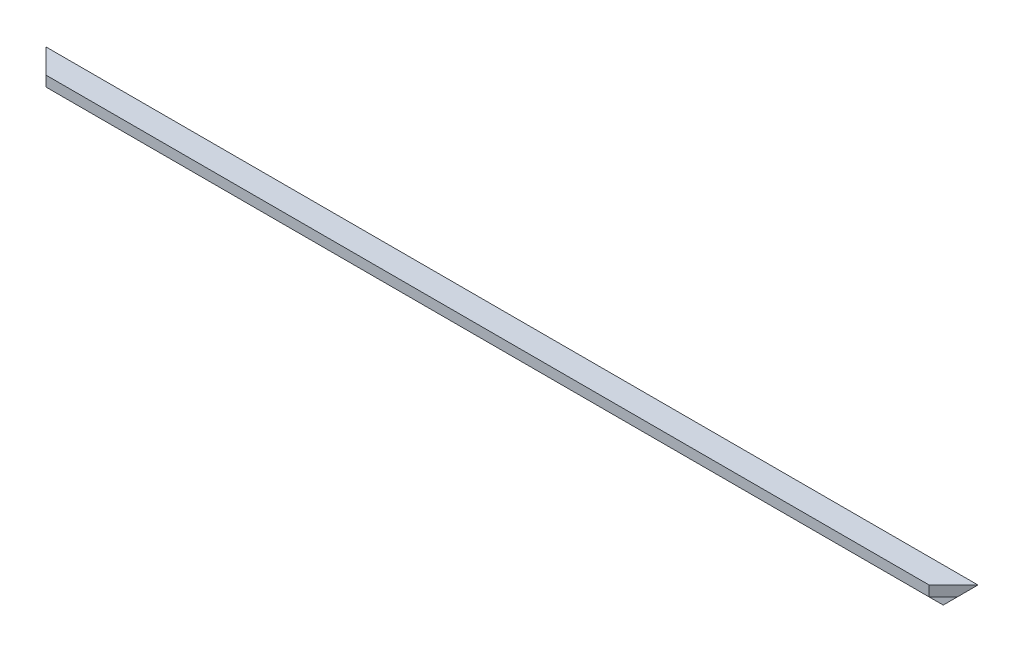
ISO-10303-21;
HEADER;
FILE_DESCRIPTION(('STEP AP214'),'2;1');
FILE_NAME('part.step','',(''),(''),'','','');
FILE_SCHEMA(('AUTOMOTIVE_DESIGN { 1 0 10303 214 1 1 1 1 }'));
ENDSEC;
DATA;
#1=APPLICATION_CONTEXT('core data for automotive mechanical design processes');
#2=APPLICATION_PROTOCOL_DEFINITION('international standard','automotive_design',2000,#1);
#3=PRODUCT_CONTEXT('',#1,'mechanical');
#4=PRODUCT('Part','Part','',(#3));
#5=PRODUCT_RELATED_PRODUCT_CATEGORY('part','',(#4));
#6=PRODUCT_DEFINITION_FORMATION('','',#4);
#7=PRODUCT_DEFINITION_CONTEXT('part definition',#1,'design');
#8=PRODUCT_DEFINITION('design','',#6,#7);
#9=PRODUCT_DEFINITION_SHAPE('','',#8);
#10=(LENGTH_UNIT() NAMED_UNIT(*) SI_UNIT(.MILLI.,.METRE.));
#11=(NAMED_UNIT(*) PLANE_ANGLE_UNIT() SI_UNIT($,.RADIAN.));
#12=(NAMED_UNIT(*) SI_UNIT($,.STERADIAN.) SOLID_ANGLE_UNIT());
#13=UNCERTAINTY_MEASURE_WITH_UNIT(LENGTH_MEASURE(1.E-05),#10,'distance_accuracy_value','');
#14=(GEOMETRIC_REPRESENTATION_CONTEXT(3) GLOBAL_UNCERTAINTY_ASSIGNED_CONTEXT((#13)) GLOBAL_UNIT_ASSIGNED_CONTEXT((#10,
#11,#12)) REPRESENTATION_CONTEXT('',''));
#15=CARTESIAN_POINT('',(0.,0.,0.));
#16=DIRECTION('',(0.,0.,1.));
#17=DIRECTION('',(1.,0.,0.));
#18=AXIS2_PLACEMENT_3D('',#15,#16,#17);
#19=CARTESIAN_POINT('',(1527.,-40.,0.));
#20=DIRECTION('',(0.,0.,1.));
#21=DIRECTION('',(1.,0.,0.));
#22=AXIS2_PLACEMENT_3D('',#19,#20,#21);
#23=PLANE('',#22);
#24=DIRECTION('',(-1.,0.,0.));
#25=VECTOR('',#24,1.);
#26=CARTESIAN_POINT('',(1527.,0.,0.));
#27=LINE('',#26,#25);
#28=CARTESIAN_POINT('',(1527.,0.,0.));
#29=VERTEX_POINT('',#28);
#30=CARTESIAN_POINT('',(0.,0.,0.));
#31=VERTEX_POINT('',#30);
#32=EDGE_CURVE('E102',#29,#31,#27,.T.);
#33=ORIENTED_EDGE('',*,*,#32,.F.);
#34=DIRECTION('',(0.707106781186548,0.707106781186547,0.));
#35=VECTOR('',#34,1.);
#36=CARTESIAN_POINT('',(1527.,0.,0.));
#37=LINE('',#36,#35);
#38=CARTESIAN_POINT('',(1487.,-40.,0.));
#39=VERTEX_POINT('',#38);
#40=EDGE_CURVE('E87',#39,#29,#37,.T.);
#41=ORIENTED_EDGE('',*,*,#40,.F.);
#42=DIRECTION('',(-1.,0.,0.));
#43=VECTOR('',#42,1.);
#44=CARTESIAN_POINT('',(1527.,-40.,0.));
#45=LINE('',#44,#43);
#46=CARTESIAN_POINT('',(40.,-40.,0.));
#47=VERTEX_POINT('',#46);
#48=EDGE_CURVE('E100',#39,#47,#45,.T.);
#49=ORIENTED_EDGE('',*,*,#48,.T.);
#50=DIRECTION('',(0.707106781186548,-0.707106781186548,0.));
#51=VECTOR('',#50,1.);
#52=CARTESIAN_POINT('',(0.,0.,0.));
#53=LINE('',#52,#51);
#54=EDGE_CURVE('E151',#31,#47,#53,.T.);
#55=ORIENTED_EDGE('',*,*,#54,.F.);
#56=EDGE_LOOP('',(#33,#41,#49,#55));
#57=FACE_BOUND('',#56,.T.);
#58=ADVANCED_FACE('F33',(#57),#23,.F.);
#59=CARTESIAN_POINT('',(1527.,0.,0.));
#60=DIRECTION('',(0.,-1.,0.));
#61=DIRECTION('',(0.,0.,-1.));
#62=AXIS2_PLACEMENT_3D('',#59,#60,#61);
#63=PLANE('',#62);
#64=DIRECTION('',(-1.,0.,0.));
#65=VECTOR('',#64,1.);
#66=CARTESIAN_POINT('',(1527.,0.,40.));
#67=LINE('',#66,#65);
#68=CARTESIAN_POINT('',(1487.,0.,40.));
#69=VERTEX_POINT('',#68);
#70=CARTESIAN_POINT('',(40.,0.,40.));
#71=VERTEX_POINT('',#70);
#72=EDGE_CURVE('E121',#69,#71,#67,.T.);
#73=ORIENTED_EDGE('',*,*,#72,.F.);
#74=DIRECTION('',(-0.707106781186548,0.,0.707106781186547));
#75=VECTOR('',#74,1.);
#76=CARTESIAN_POINT('',(1527.,0.,0.));
#77=LINE('',#76,#75);
#78=EDGE_CURVE('E126',#29,#69,#77,.T.);
#79=ORIENTED_EDGE('',*,*,#78,.F.);
#80=ORIENTED_EDGE('',*,*,#32,.T.);
#81=DIRECTION('',(-0.707106781186548,0.,-0.707106781186547));
#82=VECTOR('',#81,1.);
#83=CARTESIAN_POINT('',(40.,0.,40.));
#84=LINE('',#83,#82);
#85=EDGE_CURVE('E135',#71,#31,#84,.T.);
#86=ORIENTED_EDGE('',*,*,#85,.F.);
#87=EDGE_LOOP('',(#73,#79,#80,#86));
#88=FACE_BOUND('',#87,.T.);
#89=ADVANCED_FACE('F130',(#88),#63,.F.);
#90=CARTESIAN_POINT('',(1527.,0.,40.));
#91=DIRECTION('',(0.,0.,-1.));
#92=DIRECTION('',(-1.,0.,0.));
#93=AXIS2_PLACEMENT_3D('',#90,#91,#92);
#94=PLANE('',#93);
#95=DIRECTION('',(-1.,0.,0.));
#96=VECTOR('',#95,1.);
#97=CARTESIAN_POINT('',(1527.,-17.,40.));
#98=LINE('',#97,#96);
#99=CARTESIAN_POINT('',(1487.,-17.,40.));
#100=VERTEX_POINT('',#99);
#101=CARTESIAN_POINT('',(40.,-17.,40.));
#102=VERTEX_POINT('',#101);
#103=EDGE_CURVE('E118',#100,#102,#98,.T.);
#104=ORIENTED_EDGE('',*,*,#103,.F.);
#105=DIRECTION('',(0.,1.,0.));
#106=VECTOR('',#105,1.);
#107=CARTESIAN_POINT('',(1487.,-40.,40.));
#108=LINE('',#107,#106);
#109=EDGE_CURVE('E47',#100,#69,#108,.T.);
#110=ORIENTED_EDGE('',*,*,#109,.T.);
#111=ORIENTED_EDGE('',*,*,#72,.T.);
#112=DIRECTION('',(0.,1.,0.));
#113=VECTOR('',#112,1.);
#114=CARTESIAN_POINT('',(40.,-40.,40.));
#115=LINE('',#114,#113);
#116=EDGE_CURVE('E132',#102,#71,#115,.T.);
#117=ORIENTED_EDGE('',*,*,#116,.F.);
#118=EDGE_LOOP('',(#104,#110,#111,#117));
#119=FACE_BOUND('',#118,.T.);
#120=ADVANCED_FACE('F155',(#119),#94,.F.);
#121=CARTESIAN_POINT('',(1527.,-17.,40.));
#122=DIRECTION('',(0.,1.,0.));
#123=DIRECTION('',(0.,0.,1.));
#124=AXIS2_PLACEMENT_3D('',#121,#122,#123);
#125=PLANE('',#124);
#126=DIRECTION('',(-1.,0.,0.));
#127=VECTOR('',#126,1.);
#128=CARTESIAN_POINT('',(1527.,-17.,17.));
#129=LINE('',#128,#127);
#130=CARTESIAN_POINT('',(1510.,-17.,17.));
#131=VERTEX_POINT('',#130);
#132=CARTESIAN_POINT('',(17.0000000000001,-17.,17.));
#133=VERTEX_POINT('',#132);
#134=EDGE_CURVE('E110',#131,#133,#129,.T.);
#135=ORIENTED_EDGE('',*,*,#134,.F.);
#136=DIRECTION('',(-0.707106781186548,0.,0.707106781186547));
#137=VECTOR('',#136,1.);
#138=CARTESIAN_POINT('',(1507.,-17.,20.));
#139=LINE('',#138,#137);
#140=EDGE_CURVE('E108',#131,#100,#139,.T.);
#141=ORIENTED_EDGE('',*,*,#140,.T.);
#142=ORIENTED_EDGE('',*,*,#103,.T.);
#143=DIRECTION('',(-0.707106781186548,0.,-0.707106781186548));
#144=VECTOR('',#143,1.);
#145=CARTESIAN_POINT('',(783.499999999999,-17.,783.499999999999));
#146=LINE('',#145,#144);
#147=EDGE_CURVE('E112',#102,#133,#146,.T.);
#148=ORIENTED_EDGE('',*,*,#147,.T.);
#149=EDGE_LOOP('',(#135,#141,#142,#148));
#150=FACE_BOUND('',#149,.T.);
#151=ADVANCED_FACE('F143',(#150),#125,.F.);
#152=CARTESIAN_POINT('',(1527.,-17.,17.));
#153=DIRECTION('',(0.,0.,-1.));
#154=DIRECTION('',(0.,1.,0.));
#155=AXIS2_PLACEMENT_3D('',#152,#153,#154);
#156=PLANE('',#155);
#157=DIRECTION('',(-1.,0.,0.));
#158=VECTOR('',#157,1.);
#159=CARTESIAN_POINT('',(1527.,-40.,17.));
#160=LINE('',#159,#158);
#161=CARTESIAN_POINT('',(1487.,-40.,17.));
#162=VERTEX_POINT('',#161);
#163=CARTESIAN_POINT('',(40.,-40.,17.));
#164=VERTEX_POINT('',#163);
#165=EDGE_CURVE('E107',#162,#164,#160,.T.);
#166=ORIENTED_EDGE('',*,*,#165,.F.);
#167=DIRECTION('',(0.707106781186548,0.707106781186547,0.));
#168=VECTOR('',#167,1.);
#169=CARTESIAN_POINT('',(1518.5,-8.49999999999999,17.));
#170=LINE('',#169,#168);
#171=EDGE_CURVE('E90',#162,#131,#170,.T.);
#172=ORIENTED_EDGE('',*,*,#171,.T.);
#173=ORIENTED_EDGE('',*,*,#134,.T.);
#174=DIRECTION('',(0.707106781186548,-0.707106781186548,0.));
#175=VECTOR('',#174,1.);
#176=CARTESIAN_POINT('',(771.999999999999,-771.999999999999,16.9999999999999));
#177=LINE('',#176,#175);
#178=EDGE_CURVE('E55',#133,#164,#177,.T.);
#179=ORIENTED_EDGE('',*,*,#178,.T.);
#180=EDGE_LOOP('',(#166,#172,#173,#179));
#181=FACE_BOUND('',#180,.T.);
#182=ADVANCED_FACE('F148',(#181),#156,.F.);
#183=CARTESIAN_POINT('',(1527.,-40.,17.));
#184=DIRECTION('',(0.,1.,0.));
#185=DIRECTION('',(0.,0.,1.));
#186=AXIS2_PLACEMENT_3D('',#183,#184,#185);
#187=PLANE('',#186);
#188=ORIENTED_EDGE('',*,*,#48,.F.);
#189=DIRECTION('',(0.,0.,-1.));
#190=VECTOR('',#189,1.);
#191=CARTESIAN_POINT('',(1487.,-40.,40.));
#192=LINE('',#191,#190);
#193=EDGE_CURVE('E84',#162,#39,#192,.T.);
#194=ORIENTED_EDGE('',*,*,#193,.F.);
#195=ORIENTED_EDGE('',*,*,#165,.T.);
#196=DIRECTION('',(0.,0.,-1.));
#197=VECTOR('',#196,1.);
#198=CARTESIAN_POINT('',(40.,-40.,40.));
#199=LINE('',#198,#197);
#200=EDGE_CURVE('E103',#164,#47,#199,.T.);
#201=ORIENTED_EDGE('',*,*,#200,.T.);
#202=EDGE_LOOP('',(#188,#194,#195,#201));
#203=FACE_BOUND('',#202,.T.);
#204=ADVANCED_FACE('F106',(#203),#187,.F.);
#205=CARTESIAN_POINT('',(40.,-40.,40.));
#206=DIRECTION('',(0.707106781186548,0.,-0.707106781186548));
#207=DIRECTION('',(-0.707106781186548,0.,-0.707106781186548));
#208=AXIS2_PLACEMENT_3D('',#205,#206,#207);
#209=PLANE('',#208);
#210=ORIENTED_EDGE('',*,*,#85,.T.);
#211=DIRECTION('',(0.577350269189626,-0.577350269189626,0.577350269189626));
#212=VECTOR('',#211,1.);
#213=CARTESIAN_POINT('',(40.,-40.,40.));
#214=LINE('',#213,#212);
#215=EDGE_CURVE('E11',#31,#133,#214,.T.);
#216=ORIENTED_EDGE('',*,*,#215,.T.);
#217=ORIENTED_EDGE('',*,*,#147,.F.);
#218=ORIENTED_EDGE('',*,*,#116,.T.);
#219=EDGE_LOOP('',(#210,#216,#217,#218));
#220=FACE_BOUND('',#219,.T.);
#221=ADVANCED_FACE('F153',(#220),#209,.F.);
#222=CARTESIAN_POINT('',(1527.,-40.,0.));
#223=DIRECTION('',(-0.707106781186547,0.,-0.707106781186548));
#224=DIRECTION('',(-0.707106781186548,0.,0.707106781186547));
#225=AXIS2_PLACEMENT_3D('',#222,#223,#224);
#226=PLANE('',#225);
#227=ORIENTED_EDGE('',*,*,#140,.F.);
#228=DIRECTION('',(0.577350269189626,0.577350269189626,-0.577350269189626));
#229=VECTOR('',#228,1.);
#230=CARTESIAN_POINT('',(1513.66666666666,-13.3333333333333,13.3333333333333));
#231=LINE('',#230,#229);
#232=EDGE_CURVE('E40',#131,#29,#231,.T.);
#233=ORIENTED_EDGE('',*,*,#232,.T.);
#234=ORIENTED_EDGE('',*,*,#78,.T.);
#235=ORIENTED_EDGE('',*,*,#109,.F.);
#236=EDGE_LOOP('',(#227,#233,#234,#235));
#237=FACE_BOUND('',#236,.T.);
#238=ADVANCED_FACE('F125',(#237),#226,.F.);
#239=CARTESIAN_POINT('',(1527.,0.,40.));
#240=DIRECTION('',(-0.707106781186547,0.707106781186548,0.));
#241=DIRECTION('',(-0.707106781186548,-0.707106781186547,0.));
#242=AXIS2_PLACEMENT_3D('',#239,#240,#241);
#243=PLANE('',#242);
#244=ORIENTED_EDGE('',*,*,#193,.T.);
#245=ORIENTED_EDGE('',*,*,#40,.T.);
#246=ORIENTED_EDGE('',*,*,#232,.F.);
#247=ORIENTED_EDGE('',*,*,#171,.F.);
#248=EDGE_LOOP('',(#244,#245,#246,#247));
#249=FACE_BOUND('',#248,.T.);
#250=ADVANCED_FACE('F86',(#249),#243,.F.);
#251=CARTESIAN_POINT('',(0.,0.,40.));
#252=DIRECTION('',(0.707106781186548,0.707106781186548,0.));
#253=DIRECTION('',(-0.707106781186548,0.707106781186548,0.));
#254=AXIS2_PLACEMENT_3D('',#251,#252,#253);
#255=PLANE('',#254);
#256=ORIENTED_EDGE('',*,*,#215,.F.);
#257=ORIENTED_EDGE('',*,*,#54,.T.);
#258=ORIENTED_EDGE('',*,*,#200,.F.);
#259=ORIENTED_EDGE('',*,*,#178,.F.);
#260=EDGE_LOOP('',(#256,#257,#258,#259));
#261=FACE_BOUND('',#260,.T.);
#262=ADVANCED_FACE('F152',(#261),#255,.F.);
#263=CLOSED_SHELL('',(#58,#89,#120,#151,#182,#204,#221,#238,#250,#262));
#264=MANIFOLD_SOLID_BREP('B2',#263);
#265=ADVANCED_BREP_SHAPE_REPRESENTATION('',(#18,#264),#14);
#266=SHAPE_DEFINITION_REPRESENTATION(#9,#265);
ENDSEC;
END-ISO-10303-21;
